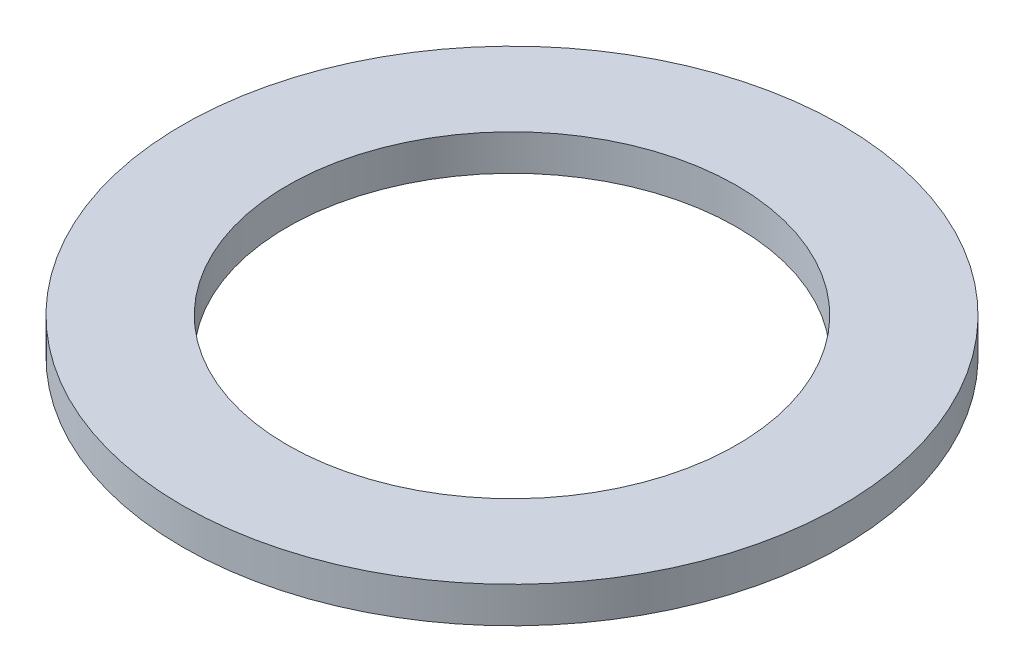
ISO-10303-21;
HEADER;
FILE_DESCRIPTION(('STEP AP214'),'2;1');
FILE_NAME('part.step','',(''),(''),'','','');
FILE_SCHEMA(('AUTOMOTIVE_DESIGN { 1 0 10303 214 1 1 1 1 }'));
ENDSEC;
DATA;
#1=APPLICATION_CONTEXT('core data for automotive mechanical design processes');
#2=APPLICATION_PROTOCOL_DEFINITION('international standard','automotive_design',2000,#1);
#3=PRODUCT_CONTEXT('',#1,'mechanical');
#4=PRODUCT('Part','Part','',(#3));
#5=PRODUCT_RELATED_PRODUCT_CATEGORY('part','',(#4));
#6=PRODUCT_DEFINITION_FORMATION('','',#4);
#7=PRODUCT_DEFINITION_CONTEXT('part definition',#1,'design');
#8=PRODUCT_DEFINITION('design','',#6,#7);
#9=PRODUCT_DEFINITION_SHAPE('','',#8);
#10=(LENGTH_UNIT() NAMED_UNIT(*) SI_UNIT(.MILLI.,.METRE.));
#11=(NAMED_UNIT(*) PLANE_ANGLE_UNIT() SI_UNIT($,.RADIAN.));
#12=(NAMED_UNIT(*) SI_UNIT($,.STERADIAN.) SOLID_ANGLE_UNIT());
#13=UNCERTAINTY_MEASURE_WITH_UNIT(LENGTH_MEASURE(1.E-05),#10,'distance_accuracy_value','');
#14=(GEOMETRIC_REPRESENTATION_CONTEXT(3) GLOBAL_UNCERTAINTY_ASSIGNED_CONTEXT((#13)) GLOBAL_UNIT_ASSIGNED_CONTEXT((#10,
#11,#12)) REPRESENTATION_CONTEXT('',''));
#15=CARTESIAN_POINT('',(0.,0.,0.));
#16=DIRECTION('',(0.,0.,1.));
#17=DIRECTION('',(1.,0.,0.));
#18=AXIS2_PLACEMENT_3D('',#15,#16,#17);
#19=CARTESIAN_POINT('',(0.,6.,0.));
#20=DIRECTION('',(0.,-1.,0.));
#21=DIRECTION('',(0.,0.,-1.));
#22=AXIS2_PLACEMENT_3D('',#19,#20,#21);
#23=CYLINDRICAL_SURFACE('',#22,55.);
#24=CARTESIAN_POINT('',(0.,6.,0.));
#25=DIRECTION('',(0.,1.,0.));
#26=DIRECTION('',(0.,0.,1.));
#27=AXIS2_PLACEMENT_3D('',#24,#25,#26);
#28=CIRCLE('',#27,55.);
#29=CARTESIAN_POINT('',(0.,6.,55.));
#30=VERTEX_POINT('',#29);
#31=EDGE_CURVE('E10',#30,#30,#28,.T.);
#32=ORIENTED_EDGE('',*,*,#31,.F.);
#33=EDGE_LOOP('',(#32));
#34=FACE_BOUND('',#33,.T.);
#35=CARTESIAN_POINT('',(0.,0.,0.));
#36=DIRECTION('',(0.,1.,0.));
#37=DIRECTION('',(0.,0.,1.));
#38=AXIS2_PLACEMENT_3D('',#35,#36,#37);
#39=CIRCLE('',#38,55.);
#40=CARTESIAN_POINT('',(0.,0.,55.));
#41=VERTEX_POINT('',#40);
#42=EDGE_CURVE('E37',#41,#41,#39,.T.);
#43=ORIENTED_EDGE('',*,*,#42,.T.);
#44=EDGE_LOOP('',(#43));
#45=FACE_BOUND('',#44,.T.);
#46=ADVANCED_FACE('F40',(#34,#45),#23,.T.);
#47=CARTESIAN_POINT('',(0.,6.,0.));
#48=DIRECTION('',(0.,1.,0.));
#49=DIRECTION('',(0.,0.,1.));
#50=AXIS2_PLACEMENT_3D('',#47,#48,#49);
#51=PLANE('',#50);
#52=CARTESIAN_POINT('',(0.,6.,0.));
#53=DIRECTION('',(0.,1.,0.));
#54=DIRECTION('',(0.,0.,1.));
#55=AXIS2_PLACEMENT_3D('',#52,#53,#54);
#56=CIRCLE('',#55,37.5);
#57=CARTESIAN_POINT('',(0.,6.,37.5));
#58=VERTEX_POINT('',#57);
#59=EDGE_CURVE('E50',#58,#58,#56,.T.);
#60=ORIENTED_EDGE('',*,*,#59,.F.);
#61=EDGE_LOOP('',(#60));
#62=FACE_BOUND('',#61,.T.);
#63=ORIENTED_EDGE('',*,*,#31,.T.);
#64=EDGE_LOOP('',(#63));
#65=FACE_BOUND('',#64,.T.);
#66=ADVANCED_FACE('F59',(#62,#65),#51,.T.);
#67=CARTESIAN_POINT('',(0.,0.,0.));
#68=DIRECTION('',(0.,1.,0.));
#69=DIRECTION('',(0.,0.,1.));
#70=AXIS2_PLACEMENT_3D('',#67,#68,#69);
#71=PLANE('',#70);
#72=CARTESIAN_POINT('',(0.,0.,0.));
#73=DIRECTION('',(0.,1.,0.));
#74=DIRECTION('',(0.,0.,1.));
#75=AXIS2_PLACEMENT_3D('',#72,#73,#74);
#76=CIRCLE('',#75,37.5);
#77=CARTESIAN_POINT('',(0.,0.,37.5));
#78=VERTEX_POINT('',#77);
#79=EDGE_CURVE('E47',#78,#78,#76,.T.);
#80=ORIENTED_EDGE('',*,*,#79,.T.);
#81=EDGE_LOOP('',(#80));
#82=FACE_BOUND('',#81,.T.);
#83=ORIENTED_EDGE('',*,*,#42,.F.);
#84=EDGE_LOOP('',(#83));
#85=FACE_BOUND('',#84,.T.);
#86=ADVANCED_FACE('F58',(#82,#85),#71,.F.);
#87=CARTESIAN_POINT('',(0.,6.,0.));
#88=DIRECTION('',(0.,-1.,0.));
#89=DIRECTION('',(0.,0.,-1.));
#90=AXIS2_PLACEMENT_3D('',#87,#88,#89);
#91=CYLINDRICAL_SURFACE('',#90,37.5);
#92=ORIENTED_EDGE('',*,*,#59,.T.);
#93=EDGE_LOOP('',(#92));
#94=FACE_BOUND('',#93,.T.);
#95=ORIENTED_EDGE('',*,*,#79,.F.);
#96=EDGE_LOOP('',(#95));
#97=FACE_BOUND('',#96,.T.);
#98=ADVANCED_FACE('F54',(#94,#97),#91,.F.);
#99=CLOSED_SHELL('',(#46,#66,#86,#98));
#100=MANIFOLD_SOLID_BREP('B2',#99);
#101=ADVANCED_BREP_SHAPE_REPRESENTATION('',(#18,#100),#14);
#102=SHAPE_DEFINITION_REPRESENTATION(#9,#101);
ENDSEC;
END-ISO-10303-21;
